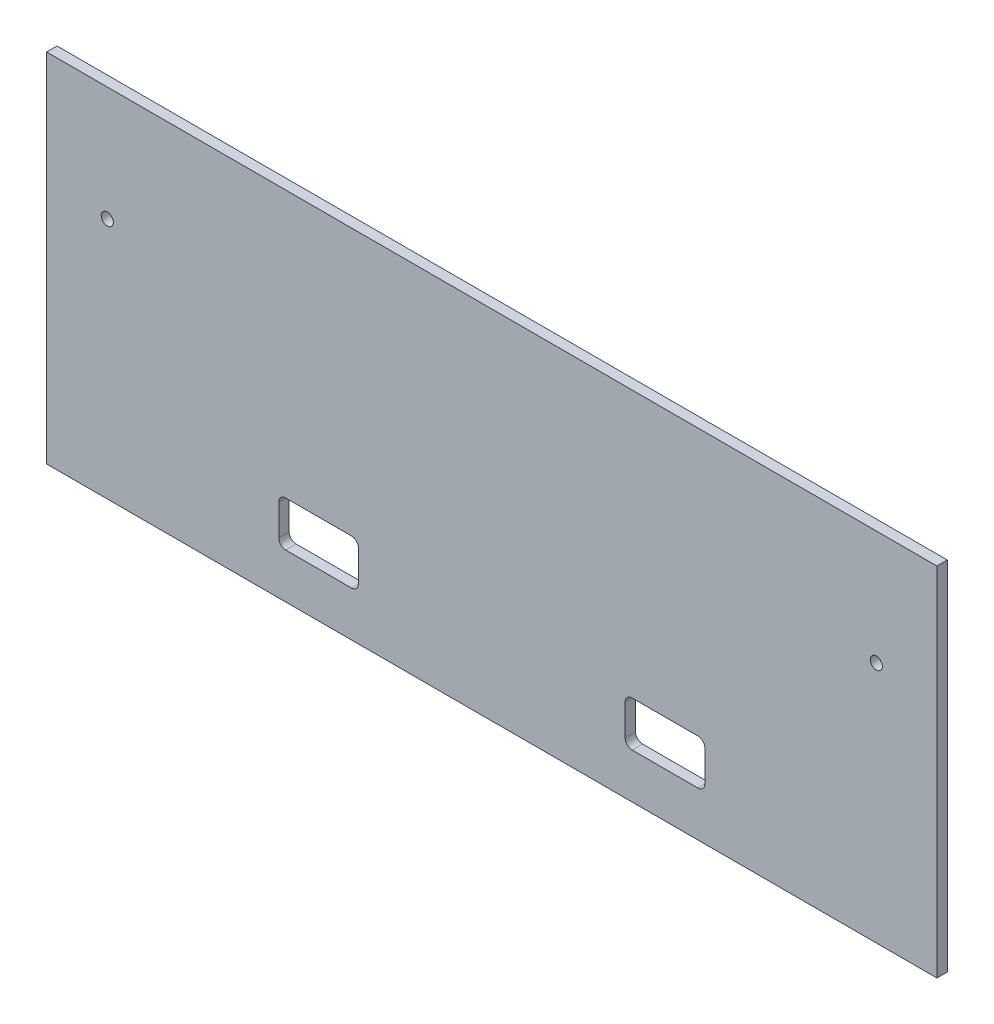
ISO-10303-21;
HEADER;
FILE_DESCRIPTION(('STEP AP214'),'2;1');
FILE_NAME('part.step','',(''),(''),'','','');
FILE_SCHEMA(('AUTOMOTIVE_DESIGN { 1 0 10303 214 1 1 1 1 }'));
ENDSEC;
DATA;
#1=APPLICATION_CONTEXT('core data for automotive mechanical design processes');
#2=APPLICATION_PROTOCOL_DEFINITION('international standard','automotive_design',2000,#1);
#3=PRODUCT_CONTEXT('',#1,'mechanical');
#4=PRODUCT('Part','Part','',(#3));
#5=PRODUCT_RELATED_PRODUCT_CATEGORY('part','',(#4));
#6=PRODUCT_DEFINITION_FORMATION('','',#4);
#7=PRODUCT_DEFINITION_CONTEXT('part definition',#1,'design');
#8=PRODUCT_DEFINITION('design','',#6,#7);
#9=PRODUCT_DEFINITION_SHAPE('','',#8);
#10=(LENGTH_UNIT() NAMED_UNIT(*) SI_UNIT(.MILLI.,.METRE.));
#11=(NAMED_UNIT(*) PLANE_ANGLE_UNIT() SI_UNIT($,.RADIAN.));
#12=(NAMED_UNIT(*) SI_UNIT($,.STERADIAN.) SOLID_ANGLE_UNIT());
#13=UNCERTAINTY_MEASURE_WITH_UNIT(LENGTH_MEASURE(1.E-05),#10,'distance_accuracy_value','');
#14=(GEOMETRIC_REPRESENTATION_CONTEXT(3) GLOBAL_UNCERTAINTY_ASSIGNED_CONTEXT((#13)) GLOBAL_UNIT_ASSIGNED_CONTEXT((#10,
#11,#12)) REPRESENTATION_CONTEXT('',''));
#15=CARTESIAN_POINT('',(0.,0.,0.));
#16=DIRECTION('',(0.,0.,1.));
#17=DIRECTION('',(1.,0.,0.));
#18=AXIS2_PLACEMENT_3D('',#15,#16,#17);
#19=CARTESIAN_POINT('',(0.,0.,3.));
#20=DIRECTION('',(0.,0.,-1.));
#21=DIRECTION('',(-1.,0.,0.));
#22=AXIS2_PLACEMENT_3D('',#19,#20,#21);
#23=PLANE('',#22);
#24=DIRECTION('',(1.,0.,0.));
#25=VECTOR('',#24,1.);
#26=CARTESIAN_POINT('',(-61.5,-38.5,3.));
#27=LINE('',#26,#25);
#28=CARTESIAN_POINT('',(-59.5,-38.5,3.));
#29=VERTEX_POINT('',#28);
#30=CARTESIAN_POINT('',(-40.5,-38.5,3.));
#31=VERTEX_POINT('',#30);
#32=EDGE_CURVE('E299',#29,#31,#27,.T.);
#33=ORIENTED_EDGE('',*,*,#32,.F.);
#34=CARTESIAN_POINT('',(-59.5,-36.5,3.));
#35=DIRECTION('',(0.,0.,-1.));
#36=DIRECTION('',(-1.,0.,0.));
#37=AXIS2_PLACEMENT_3D('',#34,#35,#36);
#38=CIRCLE('',#37,2.);
#39=CARTESIAN_POINT('',(-61.5,-36.5,3.));
#40=VERTEX_POINT('',#39);
#41=EDGE_CURVE('E262',#29,#40,#38,.T.);
#42=ORIENTED_EDGE('',*,*,#41,.T.);
#43=DIRECTION('',(0.,-1.,0.));
#44=VECTOR('',#43,1.);
#45=CARTESIAN_POINT('',(-61.5,-38.5,3.));
#46=LINE('',#45,#44);
#47=CARTESIAN_POINT('',(-61.5,-27.5,3.));
#48=VERTEX_POINT('',#47);
#49=EDGE_CURVE('E279',#48,#40,#46,.T.);
#50=ORIENTED_EDGE('',*,*,#49,.F.);
#51=CARTESIAN_POINT('',(-59.5,-27.5,3.));
#52=DIRECTION('',(0.,0.,-1.));
#53=DIRECTION('',(-1.,0.,0.));
#54=AXIS2_PLACEMENT_3D('',#51,#52,#53);
#55=CIRCLE('',#54,2.);
#56=CARTESIAN_POINT('',(-59.5,-25.5,3.));
#57=VERTEX_POINT('',#56);
#58=EDGE_CURVE('E47',#48,#57,#55,.T.);
#59=ORIENTED_EDGE('',*,*,#58,.T.);
#60=DIRECTION('',(-1.,0.,0.));
#61=VECTOR('',#60,1.);
#62=CARTESIAN_POINT('',(-61.5,-25.5,3.));
#63=LINE('',#62,#61);
#64=CARTESIAN_POINT('',(-40.5,-25.5,3.));
#65=VERTEX_POINT('',#64);
#66=EDGE_CURVE('E277',#65,#57,#63,.T.);
#67=ORIENTED_EDGE('',*,*,#66,.F.);
#68=CARTESIAN_POINT('',(-40.5,-27.5,3.));
#69=DIRECTION('',(0.,0.,-1.));
#70=DIRECTION('',(-1.,0.,0.));
#71=AXIS2_PLACEMENT_3D('',#68,#69,#70);
#72=CIRCLE('',#71,2.);
#73=CARTESIAN_POINT('',(-38.5,-27.5,3.));
#74=VERTEX_POINT('',#73);
#75=EDGE_CURVE('E270',#65,#74,#72,.T.);
#76=ORIENTED_EDGE('',*,*,#75,.T.);
#77=DIRECTION('',(0.,1.,0.));
#78=VECTOR('',#77,1.);
#79=CARTESIAN_POINT('',(-38.5,-38.5,3.));
#80=LINE('',#79,#78);
#81=CARTESIAN_POINT('',(-38.5,-36.5,3.));
#82=VERTEX_POINT('',#81);
#83=EDGE_CURVE('E285',#82,#74,#80,.T.);
#84=ORIENTED_EDGE('',*,*,#83,.F.);
#85=CARTESIAN_POINT('',(-40.5,-36.5,3.));
#86=DIRECTION('',(0.,0.,-1.));
#87=DIRECTION('',(-1.,0.,0.));
#88=AXIS2_PLACEMENT_3D('',#85,#86,#87);
#89=CIRCLE('',#88,2.);
#90=EDGE_CURVE('E266',#82,#31,#89,.T.);
#91=ORIENTED_EDGE('',*,*,#90,.T.);
#92=EDGE_LOOP('',(#33,#42,#50,#59,#67,#76,#84,#91));
#93=FACE_BOUND('',#92,.T.);
#94=DIRECTION('',(1.,0.,0.));
#95=VECTOR('',#94,1.);
#96=CARTESIAN_POINT('',(38.5,-38.5,3.));
#97=LINE('',#96,#95);
#98=CARTESIAN_POINT('',(40.5,-38.5,3.));
#99=VERTEX_POINT('',#98);
#100=CARTESIAN_POINT('',(59.5,-38.5,3.));
#101=VERTEX_POINT('',#100);
#102=EDGE_CURVE('E321',#99,#101,#97,.T.);
#103=ORIENTED_EDGE('',*,*,#102,.F.);
#104=CARTESIAN_POINT('',(40.5,-36.5,3.));
#105=DIRECTION('',(0.,0.,-1.));
#106=DIRECTION('',(-1.,0.,0.));
#107=AXIS2_PLACEMENT_3D('',#104,#105,#106);
#108=CIRCLE('',#107,2.);
#109=CARTESIAN_POINT('',(38.5,-36.5,3.));
#110=VERTEX_POINT('',#109);
#111=EDGE_CURVE('E246',#99,#110,#108,.T.);
#112=ORIENTED_EDGE('',*,*,#111,.T.);
#113=DIRECTION('',(0.,-1.,0.));
#114=VECTOR('',#113,1.);
#115=CARTESIAN_POINT('',(38.5,-38.5,3.));
#116=LINE('',#115,#114);
#117=CARTESIAN_POINT('',(38.5,-27.5,3.));
#118=VERTEX_POINT('',#117);
#119=EDGE_CURVE('E324',#118,#110,#116,.T.);
#120=ORIENTED_EDGE('',*,*,#119,.F.);
#121=CARTESIAN_POINT('',(40.5,-27.5,3.));
#122=DIRECTION('',(0.,0.,-1.));
#123=DIRECTION('',(-1.,0.,0.));
#124=AXIS2_PLACEMENT_3D('',#121,#122,#123);
#125=CIRCLE('',#124,2.);
#126=CARTESIAN_POINT('',(40.5,-25.5,3.));
#127=VERTEX_POINT('',#126);
#128=EDGE_CURVE('E258',#118,#127,#125,.T.);
#129=ORIENTED_EDGE('',*,*,#128,.T.);
#130=DIRECTION('',(-1.,0.,0.));
#131=VECTOR('',#130,1.);
#132=CARTESIAN_POINT('',(38.5,-25.5,3.));
#133=LINE('',#132,#131);
#134=CARTESIAN_POINT('',(59.5,-25.5,3.));
#135=VERTEX_POINT('',#134);
#136=EDGE_CURVE('E315',#135,#127,#133,.T.);
#137=ORIENTED_EDGE('',*,*,#136,.F.);
#138=CARTESIAN_POINT('',(59.5,-27.5,3.));
#139=DIRECTION('',(0.,0.,-1.));
#140=DIRECTION('',(-1.,0.,0.));
#141=AXIS2_PLACEMENT_3D('',#138,#139,#140);
#142=CIRCLE('',#141,2.);
#143=CARTESIAN_POINT('',(61.5,-27.5,3.));
#144=VERTEX_POINT('',#143);
#145=EDGE_CURVE('E254',#135,#144,#142,.T.);
#146=ORIENTED_EDGE('',*,*,#145,.T.);
#147=DIRECTION('',(0.,1.,0.));
#148=VECTOR('',#147,1.);
#149=CARTESIAN_POINT('',(61.5,-38.5,3.));
#150=LINE('',#149,#148);
#151=CARTESIAN_POINT('',(61.5,-36.5,3.));
#152=VERTEX_POINT('',#151);
#153=EDGE_CURVE('E318',#152,#144,#150,.T.);
#154=ORIENTED_EDGE('',*,*,#153,.F.);
#155=CARTESIAN_POINT('',(59.5,-36.5,3.));
#156=DIRECTION('',(0.,0.,-1.));
#157=DIRECTION('',(-1.,0.,0.));
#158=AXIS2_PLACEMENT_3D('',#155,#156,#157);
#159=CIRCLE('',#158,2.);
#160=EDGE_CURVE('E250',#152,#101,#159,.T.);
#161=ORIENTED_EDGE('',*,*,#160,.T.);
#162=EDGE_LOOP('',(#103,#112,#120,#129,#137,#146,#154,#161));
#163=FACE_BOUND('',#162,.T.);
#164=DIRECTION('',(0.,-1.,0.));
#165=VECTOR('',#164,1.);
#166=CARTESIAN_POINT('',(-128.5,51.5,3.));
#167=LINE('',#166,#165);
#168=CARTESIAN_POINT('',(-128.5,51.5,3.));
#169=VERTEX_POINT('',#168);
#170=CARTESIAN_POINT('',(-128.5,-51.5,3.));
#171=VERTEX_POINT('',#170);
#172=EDGE_CURVE('E188',#169,#171,#167,.T.);
#173=ORIENTED_EDGE('',*,*,#172,.T.);
#174=DIRECTION('',(1.,0.,0.));
#175=VECTOR('',#174,1.);
#176=CARTESIAN_POINT('',(128.5,-51.5,3.));
#177=LINE('',#176,#175);
#178=CARTESIAN_POINT('',(128.5,-51.5,3.));
#179=VERTEX_POINT('',#178);
#180=EDGE_CURVE('E177',#171,#179,#177,.T.);
#181=ORIENTED_EDGE('',*,*,#180,.T.);
#182=DIRECTION('',(0.,1.,0.));
#183=VECTOR('',#182,1.);
#184=CARTESIAN_POINT('',(128.5,51.5,3.));
#185=LINE('',#184,#183);
#186=CARTESIAN_POINT('',(128.5,51.5,3.));
#187=VERTEX_POINT('',#186);
#188=EDGE_CURVE('E187',#179,#187,#185,.T.);
#189=ORIENTED_EDGE('',*,*,#188,.T.);
#190=DIRECTION('',(-1.,0.,0.));
#191=VECTOR('',#190,1.);
#192=CARTESIAN_POINT('',(128.5,51.5,3.));
#193=LINE('',#192,#191);
#194=EDGE_CURVE('E193',#187,#169,#193,.T.);
#195=ORIENTED_EDGE('',*,*,#194,.T.);
#196=EDGE_LOOP('',(#173,#181,#189,#195));
#197=FACE_BOUND('',#196,.T.);
#198=CARTESIAN_POINT('',(-111.,18.4999999999999,3.));
#199=DIRECTION('',(0.,0.,1.));
#200=DIRECTION('',(1.,0.,0.));
#201=AXIS2_PLACEMENT_3D('',#198,#199,#200);
#202=CIRCLE('',#201,1.75);
#203=CARTESIAN_POINT('',(-109.25,18.4999999999999,3.));
#204=VERTEX_POINT('',#203);
#205=EDGE_CURVE('E342',#204,#204,#202,.T.);
#206=ORIENTED_EDGE('',*,*,#205,.F.);
#207=EDGE_LOOP('',(#206));
#208=FACE_BOUND('',#207,.T.);
#209=CARTESIAN_POINT('',(111.,18.4999999999999,3.));
#210=DIRECTION('',(0.,0.,1.));
#211=DIRECTION('',(-1.,0.,0.));
#212=AXIS2_PLACEMENT_3D('',#209,#210,#211);
#213=CIRCLE('',#212,1.75);
#214=CARTESIAN_POINT('',(109.25,18.4999999999999,3.));
#215=VERTEX_POINT('',#214);
#216=EDGE_CURVE('E336',#215,#215,#213,.T.);
#217=ORIENTED_EDGE('',*,*,#216,.F.);
#218=EDGE_LOOP('',(#217));
#219=FACE_BOUND('',#218,.T.);
#220=ADVANCED_FACE('F39',(#93,#163,#197,#208,#219),#23,.F.);
#221=CARTESIAN_POINT('',(0.,0.,0.));
#222=DIRECTION('',(0.,0.,-1.));
#223=DIRECTION('',(-1.,0.,0.));
#224=AXIS2_PLACEMENT_3D('',#221,#222,#223);
#225=PLANE('',#224);
#226=DIRECTION('',(-1.,0.,0.));
#227=VECTOR('',#226,1.);
#228=CARTESIAN_POINT('',(-61.5,-25.5,0.));
#229=LINE('',#228,#227);
#230=CARTESIAN_POINT('',(-40.5,-25.5,0.));
#231=VERTEX_POINT('',#230);
#232=CARTESIAN_POINT('',(-59.5,-25.5,0.));
#233=VERTEX_POINT('',#232);
#234=EDGE_CURVE('E294',#231,#233,#229,.T.);
#235=ORIENTED_EDGE('',*,*,#234,.T.);
#236=CARTESIAN_POINT('',(-59.5,-27.5,0.));
#237=DIRECTION('',(0.,0.,-1.));
#238=DIRECTION('',(-1.,0.,0.));
#239=AXIS2_PLACEMENT_3D('',#236,#237,#238);
#240=CIRCLE('',#239,2.);
#241=CARTESIAN_POINT('',(-61.5,-27.5,0.));
#242=VERTEX_POINT('',#241);
#243=EDGE_CURVE('E11',#233,#242,#240,.F.);
#244=ORIENTED_EDGE('',*,*,#243,.T.);
#245=DIRECTION('',(0.,-1.,0.));
#246=VECTOR('',#245,1.);
#247=CARTESIAN_POINT('',(-61.5,-38.5,0.));
#248=LINE('',#247,#246);
#249=CARTESIAN_POINT('',(-61.5,-36.5,0.));
#250=VERTEX_POINT('',#249);
#251=EDGE_CURVE('E292',#242,#250,#248,.T.);
#252=ORIENTED_EDGE('',*,*,#251,.T.);
#253=CARTESIAN_POINT('',(-59.5,-36.5,0.));
#254=DIRECTION('',(0.,0.,-1.));
#255=DIRECTION('',(-1.,0.,0.));
#256=AXIS2_PLACEMENT_3D('',#253,#254,#255);
#257=CIRCLE('',#256,2.);
#258=CARTESIAN_POINT('',(-59.5,-38.5,0.));
#259=VERTEX_POINT('',#258);
#260=EDGE_CURVE('E264',#250,#259,#257,.F.);
#261=ORIENTED_EDGE('',*,*,#260,.T.);
#262=DIRECTION('',(1.,0.,0.));
#263=VECTOR('',#262,1.);
#264=CARTESIAN_POINT('',(-61.5,-38.5,0.));
#265=LINE('',#264,#263);
#266=CARTESIAN_POINT('',(-40.5,-38.5,0.));
#267=VERTEX_POINT('',#266);
#268=EDGE_CURVE('E284',#259,#267,#265,.T.);
#269=ORIENTED_EDGE('',*,*,#268,.T.);
#270=CARTESIAN_POINT('',(-40.5,-36.5,0.));
#271=DIRECTION('',(0.,0.,-1.));
#272=DIRECTION('',(-1.,0.,0.));
#273=AXIS2_PLACEMENT_3D('',#270,#271,#272);
#274=CIRCLE('',#273,2.);
#275=CARTESIAN_POINT('',(-38.5,-36.5,0.));
#276=VERTEX_POINT('',#275);
#277=EDGE_CURVE('E268',#267,#276,#274,.F.);
#278=ORIENTED_EDGE('',*,*,#277,.T.);
#279=DIRECTION('',(0.,1.,0.));
#280=VECTOR('',#279,1.);
#281=CARTESIAN_POINT('',(-38.5,-38.5,0.));
#282=LINE('',#281,#280);
#283=CARTESIAN_POINT('',(-38.5,-27.5,0.));
#284=VERTEX_POINT('',#283);
#285=EDGE_CURVE('E301',#276,#284,#282,.T.);
#286=ORIENTED_EDGE('',*,*,#285,.T.);
#287=CARTESIAN_POINT('',(-40.5,-27.5,0.));
#288=DIRECTION('',(0.,0.,-1.));
#289=DIRECTION('',(-1.,0.,0.));
#290=AXIS2_PLACEMENT_3D('',#287,#288,#289);
#291=CIRCLE('',#290,2.);
#292=EDGE_CURVE('E61',#284,#231,#291,.F.);
#293=ORIENTED_EDGE('',*,*,#292,.T.);
#294=EDGE_LOOP('',(#235,#244,#252,#261,#269,#278,#286,#293));
#295=FACE_BOUND('',#294,.T.);
#296=DIRECTION('',(-1.,0.,0.));
#297=VECTOR('',#296,1.);
#298=CARTESIAN_POINT('',(38.5,-25.5,0.));
#299=LINE('',#298,#297);
#300=CARTESIAN_POINT('',(59.5,-25.5,0.));
#301=VERTEX_POINT('',#300);
#302=CARTESIAN_POINT('',(40.5,-25.5,0.));
#303=VERTEX_POINT('',#302);
#304=EDGE_CURVE('E330',#301,#303,#299,.T.);
#305=ORIENTED_EDGE('',*,*,#304,.T.);
#306=CARTESIAN_POINT('',(40.5,-27.5,0.));
#307=DIRECTION('',(0.,0.,-1.));
#308=DIRECTION('',(-1.,0.,0.));
#309=AXIS2_PLACEMENT_3D('',#306,#307,#308);
#310=CIRCLE('',#309,2.);
#311=CARTESIAN_POINT('',(38.5,-27.5,0.));
#312=VERTEX_POINT('',#311);
#313=EDGE_CURVE('E260',#303,#312,#310,.F.);
#314=ORIENTED_EDGE('',*,*,#313,.T.);
#315=DIRECTION('',(0.,-1.,0.));
#316=VECTOR('',#315,1.);
#317=CARTESIAN_POINT('',(38.5,-38.5,0.));
#318=LINE('',#317,#316);
#319=CARTESIAN_POINT('',(38.5,-36.5,0.));
#320=VERTEX_POINT('',#319);
#321=EDGE_CURVE('E327',#312,#320,#318,.T.);
#322=ORIENTED_EDGE('',*,*,#321,.T.);
#323=CARTESIAN_POINT('',(40.5,-36.5,0.));
#324=DIRECTION('',(0.,0.,-1.));
#325=DIRECTION('',(-1.,0.,0.));
#326=AXIS2_PLACEMENT_3D('',#323,#324,#325);
#327=CIRCLE('',#326,2.);
#328=CARTESIAN_POINT('',(40.5,-38.5,0.));
#329=VERTEX_POINT('',#328);
#330=EDGE_CURVE('E248',#320,#329,#327,.F.);
#331=ORIENTED_EDGE('',*,*,#330,.T.);
#332=DIRECTION('',(1.,0.,0.));
#333=VECTOR('',#332,1.);
#334=CARTESIAN_POINT('',(38.5,-38.5,0.));
#335=LINE('',#334,#333);
#336=CARTESIAN_POINT('',(59.5,-38.5,0.));
#337=VERTEX_POINT('',#336);
#338=EDGE_CURVE('E312',#329,#337,#335,.T.);
#339=ORIENTED_EDGE('',*,*,#338,.T.);
#340=CARTESIAN_POINT('',(59.5,-36.5,0.));
#341=DIRECTION('',(0.,0.,-1.));
#342=DIRECTION('',(-1.,0.,0.));
#343=AXIS2_PLACEMENT_3D('',#340,#341,#342);
#344=CIRCLE('',#343,2.);
#345=CARTESIAN_POINT('',(61.5,-36.5,0.));
#346=VERTEX_POINT('',#345);
#347=EDGE_CURVE('E252',#337,#346,#344,.F.);
#348=ORIENTED_EDGE('',*,*,#347,.T.);
#349=DIRECTION('',(0.,1.,0.));
#350=VECTOR('',#349,1.);
#351=CARTESIAN_POINT('',(61.5,-38.5,0.));
#352=LINE('',#351,#350);
#353=CARTESIAN_POINT('',(61.5,-27.5,0.));
#354=VERTEX_POINT('',#353);
#355=EDGE_CURVE('E333',#346,#354,#352,.T.);
#356=ORIENTED_EDGE('',*,*,#355,.T.);
#357=CARTESIAN_POINT('',(59.5,-27.5,0.));
#358=DIRECTION('',(0.,0.,-1.));
#359=DIRECTION('',(-1.,0.,0.));
#360=AXIS2_PLACEMENT_3D('',#357,#358,#359);
#361=CIRCLE('',#360,2.);
#362=EDGE_CURVE('E256',#354,#301,#361,.F.);
#363=ORIENTED_EDGE('',*,*,#362,.T.);
#364=EDGE_LOOP('',(#305,#314,#322,#331,#339,#348,#356,#363));
#365=FACE_BOUND('',#364,.T.);
#366=CARTESIAN_POINT('',(-111.,18.4999999999999,0.));
#367=DIRECTION('',(0.,0.,1.));
#368=DIRECTION('',(1.,0.,0.));
#369=AXIS2_PLACEMENT_3D('',#366,#367,#368);
#370=CIRCLE('',#369,1.75);
#371=CARTESIAN_POINT('',(-109.25,18.4999999999999,0.));
#372=VERTEX_POINT('',#371);
#373=EDGE_CURVE('E339',#372,#372,#370,.T.);
#374=ORIENTED_EDGE('',*,*,#373,.T.);
#375=EDGE_LOOP('',(#374));
#376=FACE_BOUND('',#375,.T.);
#377=DIRECTION('',(0.,-1.,0.));
#378=VECTOR('',#377,1.);
#379=CARTESIAN_POINT('',(-128.5,51.5,0.));
#380=LINE('',#379,#378);
#381=CARTESIAN_POINT('',(-128.5,51.5,0.));
#382=VERTEX_POINT('',#381);
#383=CARTESIAN_POINT('',(-128.5,-51.5,0.));
#384=VERTEX_POINT('',#383);
#385=EDGE_CURVE('E201',#382,#384,#380,.T.);
#386=ORIENTED_EDGE('',*,*,#385,.F.);
#387=DIRECTION('',(-1.,0.,0.));
#388=VECTOR('',#387,1.);
#389=CARTESIAN_POINT('',(128.5,51.5,0.));
#390=LINE('',#389,#388);
#391=CARTESIAN_POINT('',(128.5,51.5,0.));
#392=VERTEX_POINT('',#391);
#393=EDGE_CURVE('E197',#392,#382,#390,.T.);
#394=ORIENTED_EDGE('',*,*,#393,.F.);
#395=DIRECTION('',(0.,1.,0.));
#396=VECTOR('',#395,1.);
#397=CARTESIAN_POINT('',(128.5,51.5,0.));
#398=LINE('',#397,#396);
#399=CARTESIAN_POINT('',(128.5,-51.5,0.));
#400=VERTEX_POINT('',#399);
#401=EDGE_CURVE('E353',#400,#392,#398,.T.);
#402=ORIENTED_EDGE('',*,*,#401,.F.);
#403=DIRECTION('',(1.,0.,0.));
#404=VECTOR('',#403,1.);
#405=CARTESIAN_POINT('',(128.5,-51.5,0.));
#406=LINE('',#405,#404);
#407=EDGE_CURVE('E351',#384,#400,#406,.T.);
#408=ORIENTED_EDGE('',*,*,#407,.F.);
#409=EDGE_LOOP('',(#386,#394,#402,#408));
#410=FACE_BOUND('',#409,.T.);
#411=CARTESIAN_POINT('',(111.,18.4999999999999,0.));
#412=DIRECTION('',(0.,0.,1.));
#413=DIRECTION('',(-1.,0.,0.));
#414=AXIS2_PLACEMENT_3D('',#411,#412,#413);
#415=CIRCLE('',#414,1.75);
#416=CARTESIAN_POINT('',(109.25,18.4999999999999,0.));
#417=VERTEX_POINT('',#416);
#418=EDGE_CURVE('E311',#417,#417,#415,.T.);
#419=ORIENTED_EDGE('',*,*,#418,.T.);
#420=EDGE_LOOP('',(#419));
#421=FACE_BOUND('',#420,.T.);
#422=ADVANCED_FACE('F290',(#295,#365,#376,#410,#421),#225,.T.);
#423=CARTESIAN_POINT('',(-128.5,51.5,3.));
#424=DIRECTION('',(1.,0.,0.));
#425=DIRECTION('',(0.,0.,-1.));
#426=AXIS2_PLACEMENT_3D('',#423,#424,#425);
#427=PLANE('',#426);
#428=ORIENTED_EDGE('',*,*,#385,.T.);
#429=DIRECTION('',(0.,0.,-1.));
#430=VECTOR('',#429,1.);
#431=CARTESIAN_POINT('',(-128.5,-51.5,3.));
#432=LINE('',#431,#430);
#433=EDGE_CURVE('E181',#171,#384,#432,.T.);
#434=ORIENTED_EDGE('',*,*,#433,.F.);
#435=ORIENTED_EDGE('',*,*,#172,.F.);
#436=DIRECTION('',(0.,0.,-1.));
#437=VECTOR('',#436,1.);
#438=CARTESIAN_POINT('',(-128.5,51.5,3.));
#439=LINE('',#438,#437);
#440=EDGE_CURVE('E349',#169,#382,#439,.T.);
#441=ORIENTED_EDGE('',*,*,#440,.T.);
#442=EDGE_LOOP('',(#428,#434,#435,#441));
#443=FACE_BOUND('',#442,.T.);
#444=ADVANCED_FACE('F199',(#443),#427,.F.);
#445=CARTESIAN_POINT('',(128.5,-51.5,3.));
#446=DIRECTION('',(0.,1.,0.));
#447=DIRECTION('',(-1.,0.,0.));
#448=AXIS2_PLACEMENT_3D('',#445,#446,#447);
#449=PLANE('',#448);
#450=ORIENTED_EDGE('',*,*,#407,.T.);
#451=DIRECTION('',(0.,0.,-1.));
#452=VECTOR('',#451,1.);
#453=CARTESIAN_POINT('',(128.5,-51.5,3.));
#454=LINE('',#453,#452);
#455=EDGE_CURVE('E184',#179,#400,#454,.T.);
#456=ORIENTED_EDGE('',*,*,#455,.F.);
#457=ORIENTED_EDGE('',*,*,#180,.F.);
#458=ORIENTED_EDGE('',*,*,#433,.T.);
#459=EDGE_LOOP('',(#450,#456,#457,#458));
#460=FACE_BOUND('',#459,.T.);
#461=ADVANCED_FACE('F179',(#460),#449,.F.);
#462=CARTESIAN_POINT('',(128.5,51.5,3.));
#463=DIRECTION('',(-1.,0.,0.));
#464=DIRECTION('',(0.,0.,1.));
#465=AXIS2_PLACEMENT_3D('',#462,#463,#464);
#466=PLANE('',#465);
#467=ORIENTED_EDGE('',*,*,#401,.T.);
#468=DIRECTION('',(0.,0.,-1.));
#469=VECTOR('',#468,1.);
#470=CARTESIAN_POINT('',(128.5,51.5,3.));
#471=LINE('',#470,#469);
#472=EDGE_CURVE('E206',#187,#392,#471,.T.);
#473=ORIENTED_EDGE('',*,*,#472,.F.);
#474=ORIENTED_EDGE('',*,*,#188,.F.);
#475=ORIENTED_EDGE('',*,*,#455,.T.);
#476=EDGE_LOOP('',(#467,#473,#474,#475));
#477=FACE_BOUND('',#476,.T.);
#478=ADVANCED_FACE('F365',(#477),#466,.F.);
#479=CARTESIAN_POINT('',(128.5,51.5,3.));
#480=DIRECTION('',(0.,-1.,0.));
#481=DIRECTION('',(1.,0.,0.));
#482=AXIS2_PLACEMENT_3D('',#479,#480,#481);
#483=PLANE('',#482);
#484=ORIENTED_EDGE('',*,*,#393,.T.);
#485=ORIENTED_EDGE('',*,*,#440,.F.);
#486=ORIENTED_EDGE('',*,*,#194,.F.);
#487=ORIENTED_EDGE('',*,*,#472,.T.);
#488=EDGE_LOOP('',(#484,#485,#486,#487));
#489=FACE_BOUND('',#488,.T.);
#490=ADVANCED_FACE('F360',(#489),#483,.F.);
#491=CARTESIAN_POINT('',(-111.,18.4999999999999,3.));
#492=DIRECTION('',(0.,0.,-1.));
#493=DIRECTION('',(-1.,0.,0.));
#494=AXIS2_PLACEMENT_3D('',#491,#492,#493);
#495=CYLINDRICAL_SURFACE('',#494,1.75);
#496=ORIENTED_EDGE('',*,*,#205,.T.);
#497=EDGE_LOOP('',(#496));
#498=FACE_BOUND('',#497,.T.);
#499=ORIENTED_EDGE('',*,*,#373,.F.);
#500=EDGE_LOOP('',(#499));
#501=FACE_BOUND('',#500,.T.);
#502=ADVANCED_FACE('F372',(#498,#501),#495,.F.);
#503=CARTESIAN_POINT('',(111.,18.4999999999999,3.));
#504=DIRECTION('',(0.,0.,-1.));
#505=DIRECTION('',(-1.,0.,0.));
#506=AXIS2_PLACEMENT_3D('',#503,#504,#505);
#507=CYLINDRICAL_SURFACE('',#506,1.75);
#508=ORIENTED_EDGE('',*,*,#216,.T.);
#509=EDGE_LOOP('',(#508));
#510=FACE_BOUND('',#509,.T.);
#511=ORIENTED_EDGE('',*,*,#418,.F.);
#512=EDGE_LOOP('',(#511));
#513=FACE_BOUND('',#512,.T.);
#514=ADVANCED_FACE('F385',(#510,#513),#507,.F.);
#515=CARTESIAN_POINT('',(38.5,-38.5,-0.00100000000000013));
#516=DIRECTION('',(-1.,0.,0.));
#517=DIRECTION('',(0.,0.,1.));
#518=AXIS2_PLACEMENT_3D('',#515,#516,#517);
#519=PLANE('',#518);
#520=ORIENTED_EDGE('',*,*,#119,.T.);
#521=DIRECTION('',(0.,0.,1.));
#522=VECTOR('',#521,1.);
#523=CARTESIAN_POINT('',(38.5,-36.5,0.));
#524=LINE('',#523,#522);
#525=EDGE_CURVE('E215',#110,#320,#524,.F.);
#526=ORIENTED_EDGE('',*,*,#525,.T.);
#527=ORIENTED_EDGE('',*,*,#321,.F.);
#528=DIRECTION('',(0.,0.,1.));
#529=VECTOR('',#528,1.);
#530=CARTESIAN_POINT('',(38.5,-27.5,3.));
#531=LINE('',#530,#529);
#532=EDGE_CURVE('E212',#312,#118,#531,.T.);
#533=ORIENTED_EDGE('',*,*,#532,.T.);
#534=EDGE_LOOP('',(#520,#526,#527,#533));
#535=FACE_BOUND('',#534,.T.);
#536=ADVANCED_FACE('F389',(#535),#519,.F.);
#537=CARTESIAN_POINT('',(38.5,-25.5,-0.00100000000000013));
#538=DIRECTION('',(0.,1.,0.));
#539=DIRECTION('',(0.,0.,1.));
#540=AXIS2_PLACEMENT_3D('',#537,#538,#539);
#541=PLANE('',#540);
#542=ORIENTED_EDGE('',*,*,#304,.F.);
#543=DIRECTION('',(0.,0.,1.));
#544=VECTOR('',#543,1.);
#545=CARTESIAN_POINT('',(59.5,-25.5,3.));
#546=LINE('',#545,#544);
#547=EDGE_CURVE('E224',#301,#135,#546,.T.);
#548=ORIENTED_EDGE('',*,*,#547,.T.);
#549=ORIENTED_EDGE('',*,*,#136,.T.);
#550=DIRECTION('',(0.,0.,1.));
#551=VECTOR('',#550,1.);
#552=CARTESIAN_POINT('',(40.5,-25.5,0.));
#553=LINE('',#552,#551);
#554=EDGE_CURVE('E222',#127,#303,#553,.F.);
#555=ORIENTED_EDGE('',*,*,#554,.T.);
#556=EDGE_LOOP('',(#542,#548,#549,#555));
#557=FACE_BOUND('',#556,.T.);
#558=ADVANCED_FACE('F391',(#557),#541,.F.);
#559=CARTESIAN_POINT('',(61.5,-38.5,-0.00100000000000013));
#560=DIRECTION('',(1.,0.,0.));
#561=DIRECTION('',(0.,0.,-1.));
#562=AXIS2_PLACEMENT_3D('',#559,#560,#561);
#563=PLANE('',#562);
#564=ORIENTED_EDGE('',*,*,#355,.F.);
#565=DIRECTION('',(0.,0.,1.));
#566=VECTOR('',#565,1.);
#567=CARTESIAN_POINT('',(61.5,-36.5,3.));
#568=LINE('',#567,#566);
#569=EDGE_CURVE('E219',#346,#152,#568,.T.);
#570=ORIENTED_EDGE('',*,*,#569,.T.);
#571=ORIENTED_EDGE('',*,*,#153,.T.);
#572=DIRECTION('',(0.,0.,1.));
#573=VECTOR('',#572,1.);
#574=CARTESIAN_POINT('',(61.5,-27.5,0.));
#575=LINE('',#574,#573);
#576=EDGE_CURVE('E217',#144,#354,#575,.F.);
#577=ORIENTED_EDGE('',*,*,#576,.T.);
#578=EDGE_LOOP('',(#564,#570,#571,#577));
#579=FACE_BOUND('',#578,.T.);
#580=ADVANCED_FACE('F394',(#579),#563,.F.);
#581=CARTESIAN_POINT('',(38.5,-38.5,-0.00100000000000013));
#582=DIRECTION('',(0.,-1.,0.));
#583=DIRECTION('',(0.,0.,-1.));
#584=AXIS2_PLACEMENT_3D('',#581,#582,#583);
#585=PLANE('',#584);
#586=ORIENTED_EDGE('',*,*,#338,.F.);
#587=DIRECTION('',(0.,0.,1.));
#588=VECTOR('',#587,1.);
#589=CARTESIAN_POINT('',(40.5,-38.5,3.));
#590=LINE('',#589,#588);
#591=EDGE_CURVE('E204',#329,#99,#590,.T.);
#592=ORIENTED_EDGE('',*,*,#591,.T.);
#593=ORIENTED_EDGE('',*,*,#102,.T.);
#594=DIRECTION('',(0.,0.,1.));
#595=VECTOR('',#594,1.);
#596=CARTESIAN_POINT('',(59.5,-38.5,0.));
#597=LINE('',#596,#595);
#598=EDGE_CURVE('E202',#101,#337,#597,.F.);
#599=ORIENTED_EDGE('',*,*,#598,.T.);
#600=EDGE_LOOP('',(#586,#592,#593,#599));
#601=FACE_BOUND('',#600,.T.);
#602=ADVANCED_FACE('F398',(#601),#585,.F.);
#603=CARTESIAN_POINT('',(-61.5,-38.5,-0.00100000000000013));
#604=DIRECTION('',(-1.,0.,0.));
#605=DIRECTION('',(0.,0.,1.));
#606=AXIS2_PLACEMENT_3D('',#603,#604,#605);
#607=PLANE('',#606);
#608=ORIENTED_EDGE('',*,*,#49,.T.);
#609=DIRECTION('',(0.,0.,1.));
#610=VECTOR('',#609,1.);
#611=CARTESIAN_POINT('',(-61.5,-36.5,0.));
#612=LINE('',#611,#610);
#613=EDGE_CURVE('E235',#40,#250,#612,.F.);
#614=ORIENTED_EDGE('',*,*,#613,.T.);
#615=ORIENTED_EDGE('',*,*,#251,.F.);
#616=DIRECTION('',(0.,0.,1.));
#617=VECTOR('',#616,1.);
#618=CARTESIAN_POINT('',(-61.5,-27.5,3.));
#619=LINE('',#618,#617);
#620=EDGE_CURVE('E232',#242,#48,#619,.T.);
#621=ORIENTED_EDGE('',*,*,#620,.T.);
#622=EDGE_LOOP('',(#608,#614,#615,#621));
#623=FACE_BOUND('',#622,.T.);
#624=ADVANCED_FACE('F296',(#623),#607,.F.);
#625=CARTESIAN_POINT('',(-61.5,-25.5,-0.00100000000000013));
#626=DIRECTION('',(0.,1.,0.));
#627=DIRECTION('',(-1.,0.,0.));
#628=AXIS2_PLACEMENT_3D('',#625,#626,#627);
#629=PLANE('',#628);
#630=ORIENTED_EDGE('',*,*,#234,.F.);
#631=DIRECTION('',(0.,0.,1.));
#632=VECTOR('',#631,1.);
#633=CARTESIAN_POINT('',(-40.5,-25.5,3.));
#634=LINE('',#633,#632);
#635=EDGE_CURVE('E243',#231,#65,#634,.T.);
#636=ORIENTED_EDGE('',*,*,#635,.T.);
#637=ORIENTED_EDGE('',*,*,#66,.T.);
#638=DIRECTION('',(0.,0.,1.));
#639=VECTOR('',#638,1.);
#640=CARTESIAN_POINT('',(-59.5,-25.5,0.));
#641=LINE('',#640,#639);
#642=EDGE_CURVE('E54',#57,#233,#641,.F.);
#643=ORIENTED_EDGE('',*,*,#642,.T.);
#644=EDGE_LOOP('',(#630,#636,#637,#643));
#645=FACE_BOUND('',#644,.T.);
#646=ADVANCED_FACE('F282',(#645),#629,.F.);
#647=CARTESIAN_POINT('',(-38.5,-38.5,-0.00100000000000013));
#648=DIRECTION('',(1.,0.,0.));
#649=DIRECTION('',(0.,0.,-1.));
#650=AXIS2_PLACEMENT_3D('',#647,#648,#649);
#651=PLANE('',#650);
#652=ORIENTED_EDGE('',*,*,#285,.F.);
#653=DIRECTION('',(0.,0.,1.));
#654=VECTOR('',#653,1.);
#655=CARTESIAN_POINT('',(-38.5,-36.5,3.));
#656=LINE('',#655,#654);
#657=EDGE_CURVE('E239',#276,#82,#656,.T.);
#658=ORIENTED_EDGE('',*,*,#657,.T.);
#659=ORIENTED_EDGE('',*,*,#83,.T.);
#660=DIRECTION('',(0.,0.,1.));
#661=VECTOR('',#660,1.);
#662=CARTESIAN_POINT('',(-38.5,-27.5,0.));
#663=LINE('',#662,#661);
#664=EDGE_CURVE('E237',#74,#284,#663,.F.);
#665=ORIENTED_EDGE('',*,*,#664,.T.);
#666=EDGE_LOOP('',(#652,#658,#659,#665));
#667=FACE_BOUND('',#666,.T.);
#668=ADVANCED_FACE('F412',(#667),#651,.F.);
#669=CARTESIAN_POINT('',(-61.5,-38.5,-0.00100000000000013));
#670=DIRECTION('',(0.,-1.,0.));
#671=DIRECTION('',(0.,0.,-1.));
#672=AXIS2_PLACEMENT_3D('',#669,#670,#671);
#673=PLANE('',#672);
#674=ORIENTED_EDGE('',*,*,#268,.F.);
#675=DIRECTION('',(0.,0.,1.));
#676=VECTOR('',#675,1.);
#677=CARTESIAN_POINT('',(-59.5,-38.5,3.));
#678=LINE('',#677,#676);
#679=EDGE_CURVE('E229',#259,#29,#678,.T.);
#680=ORIENTED_EDGE('',*,*,#679,.T.);
#681=ORIENTED_EDGE('',*,*,#32,.T.);
#682=DIRECTION('',(0.,0.,1.));
#683=VECTOR('',#682,1.);
#684=CARTESIAN_POINT('',(-40.5,-38.5,0.));
#685=LINE('',#684,#683);
#686=EDGE_CURVE('E227',#31,#267,#685,.F.);
#687=ORIENTED_EDGE('',*,*,#686,.T.);
#688=EDGE_LOOP('',(#674,#680,#681,#687));
#689=FACE_BOUND('',#688,.T.);
#690=ADVANCED_FACE('F408',(#689),#673,.F.);
#691=CARTESIAN_POINT('',(40.5,-36.5,-0.00100000000000013));
#692=DIRECTION('',(0.,0.,-1.));
#693=DIRECTION('',(-1.,0.,0.));
#694=AXIS2_PLACEMENT_3D('',#691,#692,#693);
#695=CYLINDRICAL_SURFACE('',#694,2.);
#696=ORIENTED_EDGE('',*,*,#330,.F.);
#697=ORIENTED_EDGE('',*,*,#525,.F.);
#698=ORIENTED_EDGE('',*,*,#111,.F.);
#699=ORIENTED_EDGE('',*,*,#591,.F.);
#700=EDGE_LOOP('',(#696,#697,#698,#699));
#701=FACE_BOUND('',#700,.T.);
#702=ADVANCED_FACE('F411',(#701),#695,.F.);
#703=CARTESIAN_POINT('',(59.5,-36.5,-0.00100000000000013));
#704=DIRECTION('',(0.,0.,-1.));
#705=DIRECTION('',(-1.,0.,0.));
#706=AXIS2_PLACEMENT_3D('',#703,#704,#705);
#707=CYLINDRICAL_SURFACE('',#706,2.);
#708=ORIENTED_EDGE('',*,*,#347,.F.);
#709=ORIENTED_EDGE('',*,*,#598,.F.);
#710=ORIENTED_EDGE('',*,*,#160,.F.);
#711=ORIENTED_EDGE('',*,*,#569,.F.);
#712=EDGE_LOOP('',(#708,#709,#710,#711));
#713=FACE_BOUND('',#712,.T.);
#714=ADVANCED_FACE('F436',(#713),#707,.F.);
#715=CARTESIAN_POINT('',(59.5,-27.5,-0.00100000000000013));
#716=DIRECTION('',(0.,0.,-1.));
#717=DIRECTION('',(-1.,0.,0.));
#718=AXIS2_PLACEMENT_3D('',#715,#716,#717);
#719=CYLINDRICAL_SURFACE('',#718,2.);
#720=ORIENTED_EDGE('',*,*,#362,.F.);
#721=ORIENTED_EDGE('',*,*,#576,.F.);
#722=ORIENTED_EDGE('',*,*,#145,.F.);
#723=ORIENTED_EDGE('',*,*,#547,.F.);
#724=EDGE_LOOP('',(#720,#721,#722,#723));
#725=FACE_BOUND('',#724,.T.);
#726=ADVANCED_FACE('F444',(#725),#719,.F.);
#727=CARTESIAN_POINT('',(40.5,-27.5,-0.00100000000000013));
#728=DIRECTION('',(0.,0.,-1.));
#729=DIRECTION('',(-1.,0.,0.));
#730=AXIS2_PLACEMENT_3D('',#727,#728,#729);
#731=CYLINDRICAL_SURFACE('',#730,2.);
#732=ORIENTED_EDGE('',*,*,#313,.F.);
#733=ORIENTED_EDGE('',*,*,#554,.F.);
#734=ORIENTED_EDGE('',*,*,#128,.F.);
#735=ORIENTED_EDGE('',*,*,#532,.F.);
#736=EDGE_LOOP('',(#732,#733,#734,#735));
#737=FACE_BOUND('',#736,.T.);
#738=ADVANCED_FACE('F452',(#737),#731,.F.);
#739=CARTESIAN_POINT('',(-59.5,-36.5,-0.00100000000000013));
#740=DIRECTION('',(0.,0.,-1.));
#741=DIRECTION('',(-1.,0.,0.));
#742=AXIS2_PLACEMENT_3D('',#739,#740,#741);
#743=CYLINDRICAL_SURFACE('',#742,2.);
#744=ORIENTED_EDGE('',*,*,#260,.F.);
#745=ORIENTED_EDGE('',*,*,#613,.F.);
#746=ORIENTED_EDGE('',*,*,#41,.F.);
#747=ORIENTED_EDGE('',*,*,#679,.F.);
#748=EDGE_LOOP('',(#744,#745,#746,#747));
#749=FACE_BOUND('',#748,.T.);
#750=ADVANCED_FACE('F460',(#749),#743,.F.);
#751=CARTESIAN_POINT('',(-40.5,-36.5,-0.00100000000000013));
#752=DIRECTION('',(0.,0.,-1.));
#753=DIRECTION('',(-1.,0.,0.));
#754=AXIS2_PLACEMENT_3D('',#751,#752,#753);
#755=CYLINDRICAL_SURFACE('',#754,2.);
#756=ORIENTED_EDGE('',*,*,#277,.F.);
#757=ORIENTED_EDGE('',*,*,#686,.F.);
#758=ORIENTED_EDGE('',*,*,#90,.F.);
#759=ORIENTED_EDGE('',*,*,#657,.F.);
#760=EDGE_LOOP('',(#756,#757,#758,#759));
#761=FACE_BOUND('',#760,.T.);
#762=ADVANCED_FACE('F468',(#761),#755,.F.);
#763=CARTESIAN_POINT('',(-40.5,-27.5,-0.00100000000000013));
#764=DIRECTION('',(0.,0.,-1.));
#765=DIRECTION('',(-1.,0.,0.));
#766=AXIS2_PLACEMENT_3D('',#763,#764,#765);
#767=CYLINDRICAL_SURFACE('',#766,2.);
#768=ORIENTED_EDGE('',*,*,#292,.F.);
#769=ORIENTED_EDGE('',*,*,#664,.F.);
#770=ORIENTED_EDGE('',*,*,#75,.F.);
#771=ORIENTED_EDGE('',*,*,#635,.F.);
#772=EDGE_LOOP('',(#768,#769,#770,#771));
#773=FACE_BOUND('',#772,.T.);
#774=ADVANCED_FACE('F476',(#773),#767,.F.);
#775=CARTESIAN_POINT('',(-59.5,-27.5,-0.00100000000000013));
#776=DIRECTION('',(0.,0.,-1.));
#777=DIRECTION('',(-1.,0.,0.));
#778=AXIS2_PLACEMENT_3D('',#775,#776,#777);
#779=CYLINDRICAL_SURFACE('',#778,2.);
#780=ORIENTED_EDGE('',*,*,#243,.F.);
#781=ORIENTED_EDGE('',*,*,#642,.F.);
#782=ORIENTED_EDGE('',*,*,#58,.F.);
#783=ORIENTED_EDGE('',*,*,#620,.F.);
#784=EDGE_LOOP('',(#780,#781,#782,#783));
#785=FACE_BOUND('',#784,.T.);
#786=ADVANCED_FACE('F41',(#785),#779,.F.);
#787=CLOSED_SHELL('',(#220,#422,#444,#461,#478,#490,#502,#514,#536,#558,#580,#602,#624,#646,
#668,#690,#702,#714,#726,#738,#750,#762,#774,#786));
#788=MANIFOLD_SOLID_BREP('B2',#787);
#789=ADVANCED_BREP_SHAPE_REPRESENTATION('',(#18,#788),#14);
#790=SHAPE_DEFINITION_REPRESENTATION(#9,#789);
ENDSEC;
END-ISO-10303-21;
